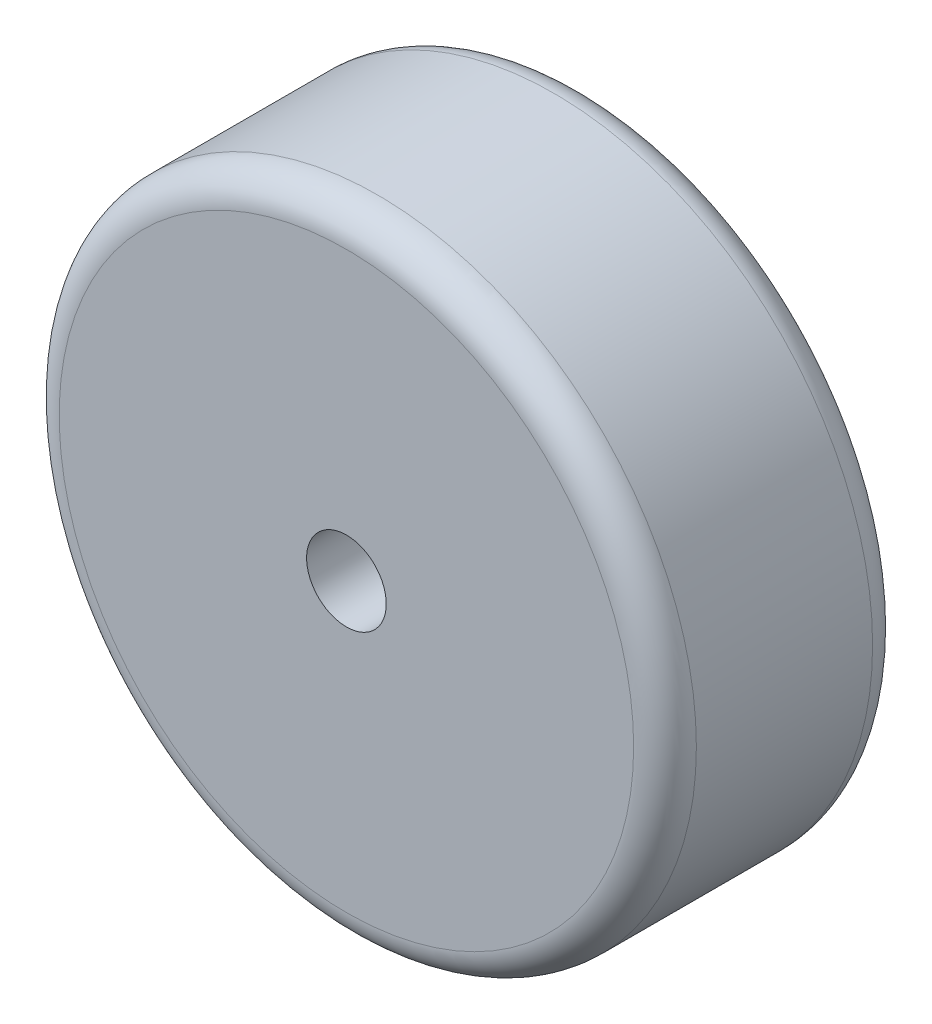
ISO-10303-21;
HEADER;
FILE_DESCRIPTION(('STEP AP214'),'2;1');
FILE_NAME('part.step','',(''),(''),'','','');
FILE_SCHEMA(('AUTOMOTIVE_DESIGN { 1 0 10303 214 1 1 1 1 }'));
ENDSEC;
DATA;
#1=APPLICATION_CONTEXT('core data for automotive mechanical design processes');
#2=APPLICATION_PROTOCOL_DEFINITION('international standard','automotive_design',2000,#1);
#3=PRODUCT_CONTEXT('',#1,'mechanical');
#4=PRODUCT('Part','Part','',(#3));
#5=PRODUCT_RELATED_PRODUCT_CATEGORY('part','',(#4));
#6=PRODUCT_DEFINITION_FORMATION('','',#4);
#7=PRODUCT_DEFINITION_CONTEXT('part definition',#1,'design');
#8=PRODUCT_DEFINITION('design','',#6,#7);
#9=PRODUCT_DEFINITION_SHAPE('','',#8);
#10=(LENGTH_UNIT() NAMED_UNIT(*) SI_UNIT(.MILLI.,.METRE.));
#11=(NAMED_UNIT(*) PLANE_ANGLE_UNIT() SI_UNIT($,.RADIAN.));
#12=(NAMED_UNIT(*) SI_UNIT($,.STERADIAN.) SOLID_ANGLE_UNIT());
#13=UNCERTAINTY_MEASURE_WITH_UNIT(LENGTH_MEASURE(1.E-05),#10,'distance_accuracy_value','');
#14=(GEOMETRIC_REPRESENTATION_CONTEXT(3) GLOBAL_UNCERTAINTY_ASSIGNED_CONTEXT((#13)) GLOBAL_UNIT_ASSIGNED_CONTEXT((#10,
#11,#12)) REPRESENTATION_CONTEXT('',''));
#15=CARTESIAN_POINT('',(0.,0.,0.));
#16=DIRECTION('',(0.,0.,1.));
#17=DIRECTION('',(1.,0.,0.));
#18=AXIS2_PLACEMENT_3D('',#15,#16,#17);
#19=CARTESIAN_POINT('',(0.,0.,38.1));
#20=DIRECTION('',(0.,0.,1.));
#21=DIRECTION('',(1.,0.,0.));
#22=AXIS2_PLACEMENT_3D('',#19,#20,#21);
#23=PLANE('',#22);
#24=CARTESIAN_POINT('',(0.,0.,38.1));
#25=DIRECTION('',(0.,0.,1.));
#26=DIRECTION('',(1.,0.,0.));
#27=AXIS2_PLACEMENT_3D('',#24,#25,#26);
#28=CIRCLE('',#27,91.6);
#29=CARTESIAN_POINT('',(91.6,0.,38.1));
#30=VERTEX_POINT('',#29);
#31=EDGE_CURVE('E47',#30,#30,#28,.T.);
#32=ORIENTED_EDGE('',*,*,#31,.T.);
#33=EDGE_LOOP('',(#32));
#34=FACE_BOUND('',#33,.T.);
#35=CARTESIAN_POINT('',(0.,0.,38.1));
#36=DIRECTION('',(0.,0.,1.));
#37=DIRECTION('',(1.,0.,0.));
#38=AXIS2_PLACEMENT_3D('',#35,#36,#37);
#39=CIRCLE('',#38,12.7);
#40=CARTESIAN_POINT('',(12.7,0.,38.1));
#41=VERTEX_POINT('',#40);
#42=EDGE_CURVE('E52',#41,#41,#39,.T.);
#43=ORIENTED_EDGE('',*,*,#42,.F.);
#44=EDGE_LOOP('',(#43));
#45=FACE_BOUND('',#44,.T.);
#46=ADVANCED_FACE('F32',(#34,#45),#23,.T.);
#47=CARTESIAN_POINT('',(0.,0.,-38.1));
#48=DIRECTION('',(0.,0.,1.));
#49=DIRECTION('',(1.,0.,0.));
#50=AXIS2_PLACEMENT_3D('',#47,#48,#49);
#51=PLANE('',#50);
#52=CARTESIAN_POINT('',(0.,0.,-38.1));
#53=DIRECTION('',(0.,0.,1.));
#54=DIRECTION('',(1.,0.,0.));
#55=AXIS2_PLACEMENT_3D('',#52,#53,#54);
#56=CIRCLE('',#55,91.6);
#57=CARTESIAN_POINT('',(91.6,0.,-38.1));
#58=VERTEX_POINT('',#57);
#59=EDGE_CURVE('E10',#58,#58,#56,.F.);
#60=ORIENTED_EDGE('',*,*,#59,.T.);
#61=EDGE_LOOP('',(#60));
#62=FACE_BOUND('',#61,.T.);
#63=CARTESIAN_POINT('',(0.,0.,-38.1));
#64=DIRECTION('',(0.,0.,1.));
#65=DIRECTION('',(1.,0.,0.));
#66=AXIS2_PLACEMENT_3D('',#63,#64,#65);
#67=CIRCLE('',#66,12.7);
#68=CARTESIAN_POINT('',(12.7,0.,-38.1));
#69=VERTEX_POINT('',#68);
#70=EDGE_CURVE('E53',#69,#69,#67,.T.);
#71=ORIENTED_EDGE('',*,*,#70,.T.);
#72=EDGE_LOOP('',(#71));
#73=FACE_BOUND('',#72,.T.);
#74=ADVANCED_FACE('F63',(#62,#73),#51,.F.);
#75=CARTESIAN_POINT('',(0.,0.,38.1));
#76=DIRECTION('',(0.,0.,-1.));
#77=DIRECTION('',(-1.,0.,0.));
#78=AXIS2_PLACEMENT_3D('',#75,#76,#77);
#79=CYLINDRICAL_SURFACE('',#78,101.6);
#80=CARTESIAN_POINT('',(0.,0.,28.1));
#81=DIRECTION('',(0.,0.,1.));
#82=DIRECTION('',(1.,0.,0.));
#83=AXIS2_PLACEMENT_3D('',#80,#81,#82);
#84=CIRCLE('',#83,101.6);
#85=CARTESIAN_POINT('',(101.6,0.,28.1));
#86=VERTEX_POINT('',#85);
#87=EDGE_CURVE('E39',#86,#86,#84,.F.);
#88=ORIENTED_EDGE('',*,*,#87,.T.);
#89=EDGE_LOOP('',(#88));
#90=FACE_BOUND('',#89,.T.);
#91=CARTESIAN_POINT('',(0.,0.,-28.1));
#92=DIRECTION('',(0.,0.,1.));
#93=DIRECTION('',(1.,0.,0.));
#94=AXIS2_PLACEMENT_3D('',#91,#92,#93);
#95=CIRCLE('',#94,101.6);
#96=CARTESIAN_POINT('',(101.6,0.,-28.1));
#97=VERTEX_POINT('',#96);
#98=EDGE_CURVE('E43',#97,#97,#95,.T.);
#99=ORIENTED_EDGE('',*,*,#98,.T.);
#100=EDGE_LOOP('',(#99));
#101=FACE_BOUND('',#100,.T.);
#102=ADVANCED_FACE('F69',(#90,#101),#79,.T.);
#103=CARTESIAN_POINT('',(0.,0.,38.1));
#104=DIRECTION('',(0.,0.,-1.));
#105=DIRECTION('',(-1.,0.,0.));
#106=AXIS2_PLACEMENT_3D('',#103,#104,#105);
#107=CYLINDRICAL_SURFACE('',#106,12.7);
#108=ORIENTED_EDGE('',*,*,#42,.T.);
#109=EDGE_LOOP('',(#108));
#110=FACE_BOUND('',#109,.T.);
#111=ORIENTED_EDGE('',*,*,#70,.F.);
#112=EDGE_LOOP('',(#111));
#113=FACE_BOUND('',#112,.T.);
#114=ADVANCED_FACE('F59',(#110,#113),#107,.F.);
#115=CARTESIAN_POINT('',(0.,0.,28.1));
#116=DIRECTION('',(0.,0.,1.));
#117=DIRECTION('',(1.,0.,0.));
#118=AXIS2_PLACEMENT_3D('',#115,#116,#117);
#119=TOROIDAL_SURFACE('',#118,91.6,10.);
#120=ORIENTED_EDGE('',*,*,#87,.F.);
#121=EDGE_LOOP('',(#120));
#122=FACE_BOUND('',#121,.T.);
#123=ORIENTED_EDGE('',*,*,#31,.F.);
#124=EDGE_LOOP('',(#123));
#125=FACE_BOUND('',#124,.T.);
#126=ADVANCED_FACE('F74',(#122,#125),#119,.T.);
#127=CARTESIAN_POINT('',(0.,0.,-28.1));
#128=DIRECTION('',(0.,0.,1.));
#129=DIRECTION('',(1.,0.,0.));
#130=AXIS2_PLACEMENT_3D('',#127,#128,#129);
#131=TOROIDAL_SURFACE('',#130,91.6,10.);
#132=ORIENTED_EDGE('',*,*,#59,.F.);
#133=EDGE_LOOP('',(#132));
#134=FACE_BOUND('',#133,.T.);
#135=ORIENTED_EDGE('',*,*,#98,.F.);
#136=EDGE_LOOP('',(#135));
#137=FACE_BOUND('',#136,.T.);
#138=ADVANCED_FACE('F34',(#134,#137),#131,.T.);
#139=CLOSED_SHELL('',(#46,#74,#102,#114,#126,#138));
#140=MANIFOLD_SOLID_BREP('B2',#139);
#141=ADVANCED_BREP_SHAPE_REPRESENTATION('',(#18,#140),#14);
#142=SHAPE_DEFINITION_REPRESENTATION(#9,#141);
ENDSEC;
END-ISO-10303-21;
